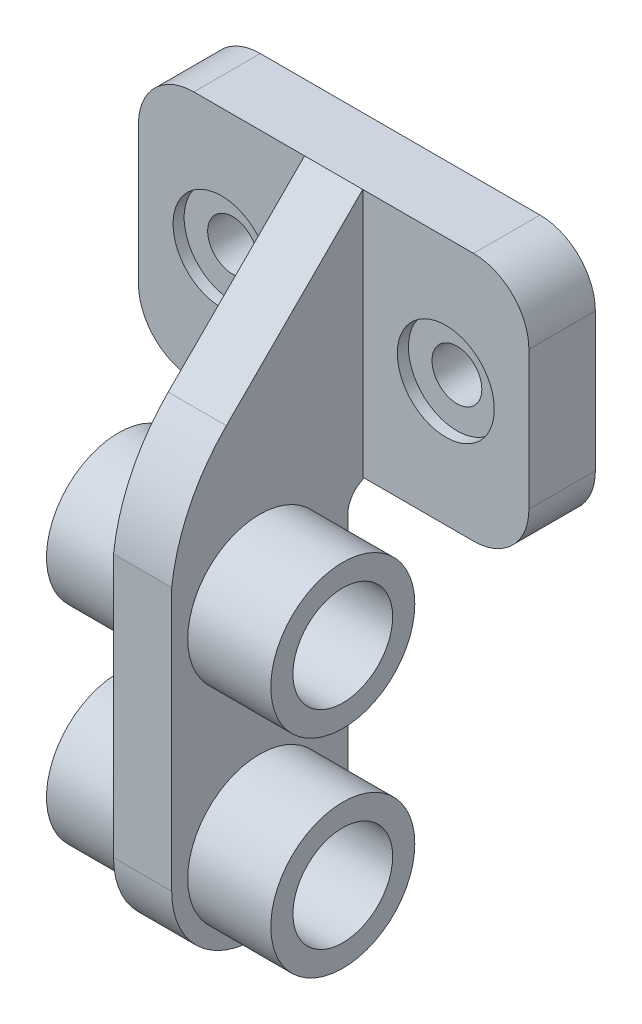
ISO-10303-21;
HEADER;
FILE_DESCRIPTION(('STEP AP214'),'2;1');
FILE_NAME('part.step','',(''),(''),'','','');
FILE_SCHEMA(('AUTOMOTIVE_DESIGN { 1 0 10303 214 1 1 1 1 }'));
ENDSEC;
DATA;
#1=APPLICATION_CONTEXT('core data for automotive mechanical design processes');
#2=APPLICATION_PROTOCOL_DEFINITION('international standard','automotive_design',2000,#1);
#3=PRODUCT_CONTEXT('',#1,'mechanical');
#4=PRODUCT('Part','Part','',(#3));
#5=PRODUCT_RELATED_PRODUCT_CATEGORY('part','',(#4));
#6=PRODUCT_DEFINITION_FORMATION('','',#4);
#7=PRODUCT_DEFINITION_CONTEXT('part definition',#1,'design');
#8=PRODUCT_DEFINITION('design','',#6,#7);
#9=PRODUCT_DEFINITION_SHAPE('','',#8);
#10=(LENGTH_UNIT() NAMED_UNIT(*) SI_UNIT(.MILLI.,.METRE.));
#11=(NAMED_UNIT(*) PLANE_ANGLE_UNIT() SI_UNIT($,.RADIAN.));
#12=(NAMED_UNIT(*) SI_UNIT($,.STERADIAN.) SOLID_ANGLE_UNIT());
#13=UNCERTAINTY_MEASURE_WITH_UNIT(LENGTH_MEASURE(1.E-05),#10,'distance_accuracy_value','');
#14=(GEOMETRIC_REPRESENTATION_CONTEXT(3) GLOBAL_UNCERTAINTY_ASSIGNED_CONTEXT((#13)) GLOBAL_UNIT_ASSIGNED_CONTEXT((#10,
#11,#12)) REPRESENTATION_CONTEXT('',''));
#15=CARTESIAN_POINT('',(0.,0.,0.));
#16=DIRECTION('',(0.,0.,1.));
#17=DIRECTION('',(1.,0.,0.));
#18=AXIS2_PLACEMENT_3D('',#15,#16,#17);
#19=CARTESIAN_POINT('',(-70.5,-45.,24.));
#20=DIRECTION('',(0.,1.,0.));
#21=DIRECTION('',(0.,0.,1.));
#22=AXIS2_PLACEMENT_3D('',#19,#20,#21);
#23=PLANE('',#22);
#24=DIRECTION('',(1.,0.,0.));
#25=VECTOR('',#24,1.);
#26=CARTESIAN_POINT('',(-70.5,-45.,24.));
#27=LINE('',#26,#25);
#28=CARTESIAN_POINT('',(10.5,-45.,24.));
#29=VERTEX_POINT('',#28);
#30=CARTESIAN_POINT('',(50.5,-45.,24.));
#31=VERTEX_POINT('',#30);
#32=EDGE_CURVE('E311',#29,#31,#27,.T.);
#33=ORIENTED_EDGE('',*,*,#32,.F.);
#34=DIRECTION('',(0.,0.,-1.));
#35=VECTOR('',#34,1.);
#36=CARTESIAN_POINT('',(10.5,-45.,93.));
#37=LINE('',#36,#35);
#38=CARTESIAN_POINT('',(10.5,-45.,20.4104553635286));
#39=VERTEX_POINT('',#38);
#40=EDGE_CURVE('E204',#29,#39,#37,.T.);
#41=ORIENTED_EDGE('',*,*,#40,.T.);
#42=DIRECTION('',(1.,0.,0.));
#43=VECTOR('',#42,1.);
#44=CARTESIAN_POINT('',(-10.5,-45.,20.4104553635286));
#45=LINE('',#44,#43);
#46=CARTESIAN_POINT('',(-10.5,-45.,20.4104553635286));
#47=VERTEX_POINT('',#46);
#48=EDGE_CURVE('E201',#39,#47,#45,.F.);
#49=ORIENTED_EDGE('',*,*,#48,.T.);
#50=DIRECTION('',(0.,0.,1.));
#51=VECTOR('',#50,1.);
#52=CARTESIAN_POINT('',(-10.5,-45.,93.));
#53=LINE('',#52,#51);
#54=CARTESIAN_POINT('',(-10.5,-45.,24.));
#55=VERTEX_POINT('',#54);
#56=EDGE_CURVE('E199',#47,#55,#53,.T.);
#57=ORIENTED_EDGE('',*,*,#56,.T.);
#58=CARTESIAN_POINT('',(-50.5,-45.,24.));
#59=VERTEX_POINT('',#58);
#60=EDGE_CURVE('E312',#59,#55,#27,.T.);
#61=ORIENTED_EDGE('',*,*,#60,.F.);
#62=DIRECTION('',(0.,0.,-1.));
#63=VECTOR('',#62,1.);
#64=CARTESIAN_POINT('',(-50.5,-45.,24.));
#65=LINE('',#64,#63);
#66=CARTESIAN_POINT('',(-50.5,-45.,0.));
#67=VERTEX_POINT('',#66);
#68=EDGE_CURVE('E338',#59,#67,#65,.T.);
#69=ORIENTED_EDGE('',*,*,#68,.T.);
#70=DIRECTION('',(1.,0.,0.));
#71=VECTOR('',#70,1.);
#72=CARTESIAN_POINT('',(-70.5,-45.,0.));
#73=LINE('',#72,#71);
#74=CARTESIAN_POINT('',(50.5,-45.,0.));
#75=VERTEX_POINT('',#74);
#76=EDGE_CURVE('E304',#67,#75,#73,.T.);
#77=ORIENTED_EDGE('',*,*,#76,.T.);
#78=DIRECTION('',(0.,0.,-1.));
#79=VECTOR('',#78,1.);
#80=CARTESIAN_POINT('',(50.5,-45.,24.));
#81=LINE('',#80,#79);
#82=EDGE_CURVE('E341',#75,#31,#81,.F.);
#83=ORIENTED_EDGE('',*,*,#82,.T.);
#84=EDGE_LOOP('',(#33,#41,#49,#57,#61,#69,#77,#83));
#85=FACE_BOUND('',#84,.T.);
#86=ADVANCED_FACE('F38',(#85),#23,.F.);
#87=CARTESIAN_POINT('',(0.,0.,24.));
#88=DIRECTION('',(0.,0.,1.));
#89=DIRECTION('',(1.,0.,0.));
#90=AXIS2_PLACEMENT_3D('',#87,#88,#89);
#91=PLANE('',#90);
#92=DIRECTION('',(0.,1.,0.));
#93=VECTOR('',#92,1.);
#94=CARTESIAN_POINT('',(10.5,45.,24.));
#95=LINE('',#94,#93);
#96=CARTESIAN_POINT('',(10.5,45.,24.));
#97=VERTEX_POINT('',#96);
#98=EDGE_CURVE('E282',#29,#97,#95,.T.);
#99=ORIENTED_EDGE('',*,*,#98,.F.);
#100=ORIENTED_EDGE('',*,*,#32,.T.);
#101=CARTESIAN_POINT('',(50.5,-25.,24.));
#102=DIRECTION('',(0.,0.,1.));
#103=DIRECTION('',(1.,0.,0.));
#104=AXIS2_PLACEMENT_3D('',#101,#102,#103);
#105=CIRCLE('',#104,20.);
#106=CARTESIAN_POINT('',(70.5,-25.,24.));
#107=VERTEX_POINT('',#106);
#108=EDGE_CURVE('E350',#31,#107,#105,.T.);
#109=ORIENTED_EDGE('',*,*,#108,.T.);
#110=DIRECTION('',(0.,1.,0.));
#111=VECTOR('',#110,1.);
#112=CARTESIAN_POINT('',(70.5,45.,24.));
#113=LINE('',#112,#111);
#114=CARTESIAN_POINT('',(70.5,25.,24.));
#115=VERTEX_POINT('',#114);
#116=EDGE_CURVE('E300',#107,#115,#113,.T.);
#117=ORIENTED_EDGE('',*,*,#116,.T.);
#118=CARTESIAN_POINT('',(50.5,25.,24.));
#119=DIRECTION('',(0.,0.,1.));
#120=DIRECTION('',(1.,0.,0.));
#121=AXIS2_PLACEMENT_3D('',#118,#119,#120);
#122=CIRCLE('',#121,20.);
#123=CARTESIAN_POINT('',(50.5,45.,24.));
#124=VERTEX_POINT('',#123);
#125=EDGE_CURVE('E344',#115,#124,#122,.T.);
#126=ORIENTED_EDGE('',*,*,#125,.T.);
#127=DIRECTION('',(-1.,0.,0.));
#128=VECTOR('',#127,1.);
#129=CARTESIAN_POINT('',(-70.5,45.,24.));
#130=LINE('',#129,#128);
#131=EDGE_CURVE('E305',#124,#97,#130,.T.);
#132=ORIENTED_EDGE('',*,*,#131,.T.);
#133=EDGE_LOOP('',(#99,#100,#109,#117,#126,#132));
#134=FACE_BOUND('',#133,.T.);
#135=CARTESIAN_POINT('',(40.5,0.,24.));
#136=DIRECTION('',(0.,0.,1.));
#137=DIRECTION('',(-1.,0.,0.));
#138=AXIS2_PLACEMENT_3D('',#135,#136,#137);
#139=CIRCLE('',#138,17.5);
#140=CARTESIAN_POINT('',(23.,0.,24.));
#141=VERTEX_POINT('',#140);
#142=EDGE_CURVE('E180',#141,#141,#139,.T.);
#143=ORIENTED_EDGE('',*,*,#142,.F.);
#144=EDGE_LOOP('',(#143));
#145=FACE_BOUND('',#144,.T.);
#146=ADVANCED_FACE('F374',(#134,#145),#91,.T.);
#147=CARTESIAN_POINT('',(70.5,45.,24.));
#148=DIRECTION('',(-1.,0.,0.));
#149=DIRECTION('',(0.,-1.,0.));
#150=AXIS2_PLACEMENT_3D('',#147,#148,#149);
#151=PLANE('',#150);
#152=ORIENTED_EDGE('',*,*,#116,.F.);
#153=DIRECTION('',(0.,0.,-1.));
#154=VECTOR('',#153,1.);
#155=CARTESIAN_POINT('',(70.5,-25.,24.));
#156=LINE('',#155,#154);
#157=CARTESIAN_POINT('',(70.5,-25.,0.));
#158=VERTEX_POINT('',#157);
#159=EDGE_CURVE('E327',#107,#158,#156,.T.);
#160=ORIENTED_EDGE('',*,*,#159,.T.);
#161=DIRECTION('',(0.,1.,0.));
#162=VECTOR('',#161,1.);
#163=CARTESIAN_POINT('',(70.5,45.,0.));
#164=LINE('',#163,#162);
#165=CARTESIAN_POINT('',(70.5,25.,0.));
#166=VERTEX_POINT('',#165);
#167=EDGE_CURVE('E291',#158,#166,#164,.T.);
#168=ORIENTED_EDGE('',*,*,#167,.T.);
#169=DIRECTION('',(0.,0.,-1.));
#170=VECTOR('',#169,1.);
#171=CARTESIAN_POINT('',(70.5,25.,24.));
#172=LINE('',#171,#170);
#173=EDGE_CURVE('E315',#166,#115,#172,.F.);
#174=ORIENTED_EDGE('',*,*,#173,.T.);
#175=EDGE_LOOP('',(#152,#160,#168,#174));
#176=FACE_BOUND('',#175,.T.);
#177=ADVANCED_FACE('F412',(#176),#151,.F.);
#178=CARTESIAN_POINT('',(-70.5,45.,24.));
#179=DIRECTION('',(0.,-1.,0.));
#180=DIRECTION('',(0.,0.,-1.));
#181=AXIS2_PLACEMENT_3D('',#178,#179,#180);
#182=PLANE('',#181);
#183=CARTESIAN_POINT('',(-10.5,45.,24.));
#184=VERTEX_POINT('',#183);
#185=CARTESIAN_POINT('',(-50.5,45.,24.));
#186=VERTEX_POINT('',#185);
#187=EDGE_CURVE('E303',#184,#186,#130,.T.);
#188=ORIENTED_EDGE('',*,*,#187,.F.);
#189=DIRECTION('',(1.,0.,0.));
#190=VECTOR('',#189,1.);
#191=CARTESIAN_POINT('',(10.5,45.,24.));
#192=LINE('',#191,#190);
#193=EDGE_CURVE('E191',#184,#97,#192,.T.);
#194=ORIENTED_EDGE('',*,*,#193,.T.);
#195=ORIENTED_EDGE('',*,*,#131,.F.);
#196=DIRECTION('',(0.,0.,-1.));
#197=VECTOR('',#196,1.);
#198=CARTESIAN_POINT('',(50.5,45.,24.));
#199=LINE('',#198,#197);
#200=CARTESIAN_POINT('',(50.5,45.,0.));
#201=VERTEX_POINT('',#200);
#202=EDGE_CURVE('E357',#124,#201,#199,.T.);
#203=ORIENTED_EDGE('',*,*,#202,.T.);
#204=DIRECTION('',(-1.,0.,0.));
#205=VECTOR('',#204,1.);
#206=CARTESIAN_POINT('',(-70.5,45.,0.));
#207=LINE('',#206,#205);
#208=CARTESIAN_POINT('',(-50.5,45.,0.));
#209=VERTEX_POINT('',#208);
#210=EDGE_CURVE('E318',#201,#209,#207,.T.);
#211=ORIENTED_EDGE('',*,*,#210,.T.);
#212=DIRECTION('',(0.,0.,-1.));
#213=VECTOR('',#212,1.);
#214=CARTESIAN_POINT('',(-50.5,45.,24.));
#215=LINE('',#214,#213);
#216=EDGE_CURVE('E360',#209,#186,#215,.F.);
#217=ORIENTED_EDGE('',*,*,#216,.T.);
#218=EDGE_LOOP('',(#188,#194,#195,#203,#211,#217));
#219=FACE_BOUND('',#218,.T.);
#220=ADVANCED_FACE('F368',(#219),#182,.F.);
#221=CARTESIAN_POINT('',(-70.5,45.,24.));
#222=DIRECTION('',(1.,0.,0.));
#223=DIRECTION('',(0.,0.,-1.));
#224=AXIS2_PLACEMENT_3D('',#221,#222,#223);
#225=PLANE('',#224);
#226=DIRECTION('',(0.,-1.,0.));
#227=VECTOR('',#226,1.);
#228=CARTESIAN_POINT('',(-70.5,45.,0.));
#229=LINE('',#228,#227);
#230=CARTESIAN_POINT('',(-70.5,25.,0.));
#231=VERTEX_POINT('',#230);
#232=CARTESIAN_POINT('',(-70.5,-25.,0.));
#233=VERTEX_POINT('',#232);
#234=EDGE_CURVE('E321',#231,#233,#229,.T.);
#235=ORIENTED_EDGE('',*,*,#234,.T.);
#236=DIRECTION('',(0.,0.,-1.));
#237=VECTOR('',#236,1.);
#238=CARTESIAN_POINT('',(-70.5,-25.,24.));
#239=LINE('',#238,#237);
#240=CARTESIAN_POINT('',(-70.5,-25.,24.));
#241=VERTEX_POINT('',#240);
#242=EDGE_CURVE('E355',#233,#241,#239,.F.);
#243=ORIENTED_EDGE('',*,*,#242,.T.);
#244=DIRECTION('',(0.,-1.,0.));
#245=VECTOR('',#244,1.);
#246=CARTESIAN_POINT('',(-70.5,45.,24.));
#247=LINE('',#246,#245);
#248=CARTESIAN_POINT('',(-70.5,25.,24.));
#249=VERTEX_POINT('',#248);
#250=EDGE_CURVE('E308',#249,#241,#247,.T.);
#251=ORIENTED_EDGE('',*,*,#250,.F.);
#252=DIRECTION('',(0.,0.,-1.));
#253=VECTOR('',#252,1.);
#254=CARTESIAN_POINT('',(-70.5,25.,24.));
#255=LINE('',#254,#253);
#256=EDGE_CURVE('E352',#249,#231,#255,.T.);
#257=ORIENTED_EDGE('',*,*,#256,.T.);
#258=EDGE_LOOP('',(#235,#243,#251,#257));
#259=FACE_BOUND('',#258,.T.);
#260=ADVANCED_FACE('F399',(#259),#225,.F.);
#261=DIRECTION('',(0.,-1.,0.));
#262=VECTOR('',#261,1.);
#263=CARTESIAN_POINT('',(-10.5,45.,24.));
#264=LINE('',#263,#262);
#265=EDGE_CURVE('E181',#184,#55,#264,.T.);
#266=ORIENTED_EDGE('',*,*,#265,.F.);
#267=ORIENTED_EDGE('',*,*,#187,.T.);
#268=CARTESIAN_POINT('',(-50.5,25.,24.));
#269=DIRECTION('',(0.,0.,1.));
#270=DIRECTION('',(1.,0.,0.));
#271=AXIS2_PLACEMENT_3D('',#268,#269,#270);
#272=CIRCLE('',#271,20.);
#273=EDGE_CURVE('E346',#186,#249,#272,.T.);
#274=ORIENTED_EDGE('',*,*,#273,.T.);
#275=ORIENTED_EDGE('',*,*,#250,.T.);
#276=CARTESIAN_POINT('',(-50.5,-25.,24.));
#277=DIRECTION('',(0.,0.,1.));
#278=DIRECTION('',(1.,0.,0.));
#279=AXIS2_PLACEMENT_3D('',#276,#277,#278);
#280=CIRCLE('',#279,20.);
#281=EDGE_CURVE('E348',#241,#59,#280,.T.);
#282=ORIENTED_EDGE('',*,*,#281,.T.);
#283=ORIENTED_EDGE('',*,*,#60,.T.);
#284=EDGE_LOOP('',(#266,#267,#274,#275,#282,#283));
#285=FACE_BOUND('',#284,.T.);
#286=CARTESIAN_POINT('',(-40.5,0.,24.));
#287=DIRECTION('',(0.,0.,1.));
#288=DIRECTION('',(1.,0.,0.));
#289=AXIS2_PLACEMENT_3D('',#286,#287,#288);
#290=CIRCLE('',#289,17.5);
#291=CARTESIAN_POINT('',(-23.,0.,24.));
#292=VERTEX_POINT('',#291);
#293=EDGE_CURVE('E292',#292,#292,#290,.T.);
#294=ORIENTED_EDGE('',*,*,#293,.F.);
#295=EDGE_LOOP('',(#294));
#296=FACE_BOUND('',#295,.T.);
#297=ADVANCED_FACE('F384',(#285,#296),#91,.T.);
#298=CARTESIAN_POINT('',(0.,0.,0.));
#299=DIRECTION('',(0.,0.,1.));
#300=DIRECTION('',(1.,0.,0.));
#301=AXIS2_PLACEMENT_3D('',#298,#299,#300);
#302=PLANE('',#301);
#303=CARTESIAN_POINT('',(-40.5,0.,0.));
#304=DIRECTION('',(0.,0.,1.));
#305=DIRECTION('',(1.,0.,0.));
#306=AXIS2_PLACEMENT_3D('',#303,#304,#305);
#307=CIRCLE('',#306,9.);
#308=CARTESIAN_POINT('',(-31.5,0.,0.));
#309=VERTEX_POINT('',#308);
#310=EDGE_CURVE('E42',#309,#309,#307,.T.);
#311=ORIENTED_EDGE('',*,*,#310,.T.);
#312=EDGE_LOOP('',(#311));
#313=FACE_BOUND('',#312,.T.);
#314=CARTESIAN_POINT('',(40.5,0.,0.));
#315=DIRECTION('',(0.,0.,1.));
#316=DIRECTION('',(1.,0.,0.));
#317=AXIS2_PLACEMENT_3D('',#314,#315,#316);
#318=CIRCLE('',#317,9.);
#319=CARTESIAN_POINT('',(49.5,0.,0.));
#320=VERTEX_POINT('',#319);
#321=EDGE_CURVE('E234',#320,#320,#318,.T.);
#322=ORIENTED_EDGE('',*,*,#321,.T.);
#323=EDGE_LOOP('',(#322));
#324=FACE_BOUND('',#323,.T.);
#325=ORIENTED_EDGE('',*,*,#167,.F.);
#326=CARTESIAN_POINT('',(50.5,-25.,0.));
#327=DIRECTION('',(0.,0.,1.));
#328=DIRECTION('',(1.,0.,0.));
#329=AXIS2_PLACEMENT_3D('',#326,#327,#328);
#330=CIRCLE('',#329,20.);
#331=EDGE_CURVE('E336',#158,#75,#330,.F.);
#332=ORIENTED_EDGE('',*,*,#331,.T.);
#333=ORIENTED_EDGE('',*,*,#76,.F.);
#334=CARTESIAN_POINT('',(-50.5,-25.,0.));
#335=DIRECTION('',(0.,0.,1.));
#336=DIRECTION('',(1.,0.,0.));
#337=AXIS2_PLACEMENT_3D('',#334,#335,#336);
#338=CIRCLE('',#337,20.);
#339=EDGE_CURVE('E334',#67,#233,#338,.F.);
#340=ORIENTED_EDGE('',*,*,#339,.T.);
#341=ORIENTED_EDGE('',*,*,#234,.F.);
#342=CARTESIAN_POINT('',(-50.5,25.,0.));
#343=DIRECTION('',(0.,0.,1.));
#344=DIRECTION('',(1.,0.,0.));
#345=AXIS2_PLACEMENT_3D('',#342,#343,#344);
#346=CIRCLE('',#345,20.);
#347=EDGE_CURVE('E332',#231,#209,#346,.F.);
#348=ORIENTED_EDGE('',*,*,#347,.T.);
#349=ORIENTED_EDGE('',*,*,#210,.F.);
#350=CARTESIAN_POINT('',(50.5,25.,0.));
#351=DIRECTION('',(0.,0.,1.));
#352=DIRECTION('',(1.,0.,0.));
#353=AXIS2_PLACEMENT_3D('',#350,#351,#352);
#354=CIRCLE('',#353,20.);
#355=EDGE_CURVE('E330',#201,#166,#354,.F.);
#356=ORIENTED_EDGE('',*,*,#355,.T.);
#357=EDGE_LOOP('',(#325,#332,#333,#340,#341,#348,#349,#356));
#358=FACE_BOUND('',#357,.T.);
#359=ADVANCED_FACE('F397',(#313,#324,#358),#302,.F.);
#360=CARTESIAN_POINT('',(50.5,-25.,24.));
#361=DIRECTION('',(0.,0.,-1.));
#362=DIRECTION('',(-1.,0.,0.));
#363=AXIS2_PLACEMENT_3D('',#360,#361,#362);
#364=CYLINDRICAL_SURFACE('',#363,20.);
#365=ORIENTED_EDGE('',*,*,#108,.F.);
#366=ORIENTED_EDGE('',*,*,#82,.F.);
#367=ORIENTED_EDGE('',*,*,#331,.F.);
#368=ORIENTED_EDGE('',*,*,#159,.F.);
#369=EDGE_LOOP('',(#365,#366,#367,#368));
#370=FACE_BOUND('',#369,.T.);
#371=ADVANCED_FACE('F416',(#370),#364,.T.);
#372=CARTESIAN_POINT('',(-50.5,-25.,24.));
#373=DIRECTION('',(0.,0.,-1.));
#374=DIRECTION('',(-1.,0.,0.));
#375=AXIS2_PLACEMENT_3D('',#372,#373,#374);
#376=CYLINDRICAL_SURFACE('',#375,20.);
#377=ORIENTED_EDGE('',*,*,#281,.F.);
#378=ORIENTED_EDGE('',*,*,#242,.F.);
#379=ORIENTED_EDGE('',*,*,#339,.F.);
#380=ORIENTED_EDGE('',*,*,#68,.F.);
#381=EDGE_LOOP('',(#377,#378,#379,#380));
#382=FACE_BOUND('',#381,.T.);
#383=ADVANCED_FACE('F392',(#382),#376,.T.);
#384=CARTESIAN_POINT('',(-50.5,25.,24.));
#385=DIRECTION('',(0.,0.,-1.));
#386=DIRECTION('',(-1.,0.,0.));
#387=AXIS2_PLACEMENT_3D('',#384,#385,#386);
#388=CYLINDRICAL_SURFACE('',#387,20.);
#389=ORIENTED_EDGE('',*,*,#273,.F.);
#390=ORIENTED_EDGE('',*,*,#216,.F.);
#391=ORIENTED_EDGE('',*,*,#347,.F.);
#392=ORIENTED_EDGE('',*,*,#256,.F.);
#393=EDGE_LOOP('',(#389,#390,#391,#392));
#394=FACE_BOUND('',#393,.T.);
#395=ADVANCED_FACE('F404',(#394),#388,.T.);
#396=CARTESIAN_POINT('',(50.5,25.,24.));
#397=DIRECTION('',(0.,0.,-1.));
#398=DIRECTION('',(-1.,0.,0.));
#399=AXIS2_PLACEMENT_3D('',#396,#397,#398);
#400=CYLINDRICAL_SURFACE('',#399,20.);
#401=ORIENTED_EDGE('',*,*,#125,.F.);
#402=ORIENTED_EDGE('',*,*,#173,.F.);
#403=ORIENTED_EDGE('',*,*,#355,.F.);
#404=ORIENTED_EDGE('',*,*,#202,.F.);
#405=EDGE_LOOP('',(#401,#402,#403,#404));
#406=FACE_BOUND('',#405,.T.);
#407=ADVANCED_FACE('F408',(#406),#400,.T.);
#408=CARTESIAN_POINT('',(40.5,0.,20.));
#409=DIRECTION('',(0.,0.,1.));
#410=DIRECTION('',(1.,0.,0.));
#411=AXIS2_PLACEMENT_3D('',#408,#409,#410);
#412=CYLINDRICAL_SURFACE('',#411,17.5);
#413=CARTESIAN_POINT('',(40.5,0.,20.));
#414=DIRECTION('',(0.,0.,1.));
#415=DIRECTION('',(-1.,0.,0.));
#416=AXIS2_PLACEMENT_3D('',#413,#414,#415);
#417=CIRCLE('',#416,17.5);
#418=CARTESIAN_POINT('',(23.,0.,20.));
#419=VERTEX_POINT('',#418);
#420=EDGE_CURVE('E295',#419,#419,#417,.T.);
#421=ORIENTED_EDGE('',*,*,#420,.F.);
#422=EDGE_LOOP('',(#421));
#423=FACE_BOUND('',#422,.T.);
#424=ORIENTED_EDGE('',*,*,#142,.T.);
#425=EDGE_LOOP('',(#424));
#426=FACE_BOUND('',#425,.T.);
#427=ADVANCED_FACE('F464',(#423,#426),#412,.F.);
#428=CARTESIAN_POINT('',(40.5,0.,20.));
#429=DIRECTION('',(0.,0.,-1.));
#430=DIRECTION('',(-1.,0.,0.));
#431=AXIS2_PLACEMENT_3D('',#428,#429,#430);
#432=PLANE('',#431);
#433=CARTESIAN_POINT('',(40.5,0.,20.));
#434=DIRECTION('',(0.,0.,1.));
#435=DIRECTION('',(1.,0.,0.));
#436=AXIS2_PLACEMENT_3D('',#433,#434,#435);
#437=CIRCLE('',#436,9.);
#438=CARTESIAN_POINT('',(49.5,0.,20.));
#439=VERTEX_POINT('',#438);
#440=EDGE_CURVE('E237',#439,#439,#437,.T.);
#441=ORIENTED_EDGE('',*,*,#440,.F.);
#442=EDGE_LOOP('',(#441));
#443=FACE_BOUND('',#442,.T.);
#444=ORIENTED_EDGE('',*,*,#420,.T.);
#445=EDGE_LOOP('',(#444));
#446=FACE_BOUND('',#445,.T.);
#447=ADVANCED_FACE('F500',(#443,#446),#432,.F.);
#448=CARTESIAN_POINT('',(-40.5,0.,20.));
#449=DIRECTION('',(0.,0.,1.));
#450=DIRECTION('',(1.,0.,0.));
#451=AXIS2_PLACEMENT_3D('',#448,#449,#450);
#452=CYLINDRICAL_SURFACE('',#451,17.5);
#453=CARTESIAN_POINT('',(-40.5,0.,20.));
#454=DIRECTION('',(0.,0.,1.));
#455=DIRECTION('',(1.,0.,0.));
#456=AXIS2_PLACEMENT_3D('',#453,#454,#455);
#457=CIRCLE('',#456,17.5);
#458=CARTESIAN_POINT('',(-23.,0.,20.));
#459=VERTEX_POINT('',#458);
#460=EDGE_CURVE('E288',#459,#459,#457,.T.);
#461=ORIENTED_EDGE('',*,*,#460,.F.);
#462=EDGE_LOOP('',(#461));
#463=FACE_BOUND('',#462,.T.);
#464=ORIENTED_EDGE('',*,*,#293,.T.);
#465=EDGE_LOOP('',(#464));
#466=FACE_BOUND('',#465,.T.);
#467=ADVANCED_FACE('F496',(#463,#466),#452,.F.);
#468=CARTESIAN_POINT('',(-40.5,0.,20.));
#469=DIRECTION('',(0.,0.,1.));
#470=DIRECTION('',(1.,0.,0.));
#471=AXIS2_PLACEMENT_3D('',#468,#469,#470);
#472=PLANE('',#471);
#473=CARTESIAN_POINT('',(-40.5,0.,20.));
#474=DIRECTION('',(0.,0.,1.));
#475=DIRECTION('',(1.,0.,0.));
#476=AXIS2_PLACEMENT_3D('',#473,#474,#475);
#477=CIRCLE('',#476,9.);
#478=CARTESIAN_POINT('',(-31.5,0.,20.));
#479=VERTEX_POINT('',#478);
#480=EDGE_CURVE('E248',#479,#479,#477,.T.);
#481=ORIENTED_EDGE('',*,*,#480,.F.);
#482=EDGE_LOOP('',(#481));
#483=FACE_BOUND('',#482,.T.);
#484=ORIENTED_EDGE('',*,*,#460,.T.);
#485=EDGE_LOOP('',(#484));
#486=FACE_BOUND('',#485,.T.);
#487=ADVANCED_FACE('F492',(#483,#486),#472,.T.);
#488=CARTESIAN_POINT('',(10.5,45.,93.));
#489=DIRECTION('',(-1.,0.,0.));
#490=DIRECTION('',(0.,0.,1.));
#491=AXIS2_PLACEMENT_3D('',#488,#489,#490);
#492=PLANE('',#491);
#493=CARTESIAN_POINT('',(10.5,-139.,61.2052276817643));
#494=DIRECTION('',(-1.,0.,0.));
#495=DIRECTION('',(0.,0.,1.));
#496=AXIS2_PLACEMENT_3D('',#493,#494,#495);
#497=CIRCLE('',#496,26.);
#498=CARTESIAN_POINT('',(10.5,-139.,87.2052276817643));
#499=VERTEX_POINT('',#498);
#500=EDGE_CURVE('E232',#499,#499,#497,.T.);
#501=ORIENTED_EDGE('',*,*,#500,.T.);
#502=EDGE_LOOP('',(#501));
#503=FACE_BOUND('',#502,.T.);
#504=CARTESIAN_POINT('',(10.5,-64.,61.2052276817643));
#505=DIRECTION('',(-1.,0.,0.));
#506=DIRECTION('',(0.,0.,1.));
#507=AXIS2_PLACEMENT_3D('',#504,#505,#506);
#508=CIRCLE('',#507,26.);
#509=CARTESIAN_POINT('',(10.5,-64.,87.2052276817643));
#510=VERTEX_POINT('',#509);
#511=EDGE_CURVE('E228',#510,#510,#508,.T.);
#512=ORIENTED_EDGE('',*,*,#511,.T.);
#513=EDGE_LOOP('',(#512));
#514=FACE_BOUND('',#513,.T.);
#515=DIRECTION('',(0.,0.,1.));
#516=VECTOR('',#515,1.);
#517=CARTESIAN_POINT('',(10.5,-170.,93.));
#518=LINE('',#517,#516);
#519=CARTESIAN_POINT('',(10.5,-170.,59.4104553635286));
#520=VERTEX_POINT('',#519);
#521=CARTESIAN_POINT('',(10.5,-170.,63.));
#522=VERTEX_POINT('',#521);
#523=EDGE_CURVE('E273',#520,#522,#518,.T.);
#524=ORIENTED_EDGE('',*,*,#523,.F.);
#525=CARTESIAN_POINT('',(10.5,-140.,59.4104553635286));
#526=DIRECTION('',(-1.,0.,0.));
#527=DIRECTION('',(0.,0.,1.));
#528=AXIS2_PLACEMENT_3D('',#525,#526,#527);
#529=CIRCLE('',#528,30.);
#530=CARTESIAN_POINT('',(10.5,-140.,29.4104553635286));
#531=VERTEX_POINT('',#530);
#532=EDGE_CURVE('E220',#520,#531,#529,.F.);
#533=ORIENTED_EDGE('',*,*,#532,.T.);
#534=DIRECTION('',(0.,1.,0.));
#535=VECTOR('',#534,1.);
#536=CARTESIAN_POINT('',(10.5,-170.,29.4104553635286));
#537=LINE('',#536,#535);
#538=CARTESIAN_POINT('',(10.5,-54.,29.4104553635286));
#539=VERTEX_POINT('',#538);
#540=EDGE_CURVE('E279',#531,#539,#537,.T.);
#541=ORIENTED_EDGE('',*,*,#540,.T.);
#542=CARTESIAN_POINT('',(10.5,-54.,20.4104553635286));
#543=DIRECTION('',(-1.,0.,0.));
#544=DIRECTION('',(0.,0.,1.));
#545=AXIS2_PLACEMENT_3D('',#542,#543,#544);
#546=CIRCLE('',#545,9.);
#547=EDGE_CURVE('E207',#539,#39,#546,.T.);
#548=ORIENTED_EDGE('',*,*,#547,.T.);
#549=ORIENTED_EDGE('',*,*,#40,.F.);
#550=ORIENTED_EDGE('',*,*,#98,.T.);
#551=DIRECTION('',(0.,-0.707106781186547,0.707106781186548));
#552=VECTOR('',#551,1.);
#553=CARTESIAN_POINT('',(10.5,-24.,93.));
#554=LINE('',#553,#552);
#555=CARTESIAN_POINT('',(10.5,-4.26181675531233,73.2618167553124));
#556=VERTEX_POINT('',#555);
#557=EDGE_CURVE('E186',#97,#556,#554,.T.);
#558=ORIENTED_EDGE('',*,*,#557,.T.);
#559=CARTESIAN_POINT('',(10.5,-53.0521846571841,24.4714488534406));
#560=DIRECTION('',(-1.,0.,0.));
#561=DIRECTION('',(0.,0.,1.));
#562=AXIS2_PLACEMENT_3D('',#559,#560,#561);
#563=CIRCLE('',#562,69.);
#564=CARTESIAN_POINT('',(10.5,-45.,93.));
#565=VERTEX_POINT('',#564);
#566=EDGE_CURVE('E188',#556,#565,#563,.F.);
#567=ORIENTED_EDGE('',*,*,#566,.T.);
#568=DIRECTION('',(0.,1.,0.));
#569=VECTOR('',#568,1.);
#570=CARTESIAN_POINT('',(10.5,-170.,93.));
#571=LINE('',#570,#569);
#572=CARTESIAN_POINT('',(10.5,-140.,93.));
#573=VERTEX_POINT('',#572);
#574=EDGE_CURVE('E170',#573,#565,#571,.T.);
#575=ORIENTED_EDGE('',*,*,#574,.F.);
#576=CARTESIAN_POINT('',(10.5,-140.,63.));
#577=DIRECTION('',(-1.,0.,0.));
#578=DIRECTION('',(0.,0.,1.));
#579=AXIS2_PLACEMENT_3D('',#576,#577,#578);
#580=CIRCLE('',#579,30.);
#581=EDGE_CURVE('E218',#573,#522,#580,.F.);
#582=ORIENTED_EDGE('',*,*,#581,.T.);
#583=EDGE_LOOP('',(#524,#533,#541,#548,#549,#550,#558,#567,#575,#582));
#584=FACE_BOUND('',#583,.T.);
#585=ADVANCED_FACE('F379',(#503,#514,#584),#492,.F.);
#586=CARTESIAN_POINT('',(-10.5,45.,93.));
#587=DIRECTION('',(1.,0.,0.));
#588=DIRECTION('',(0.,0.,-1.));
#589=AXIS2_PLACEMENT_3D('',#586,#587,#588);
#590=PLANE('',#589);
#591=CARTESIAN_POINT('',(-10.5,-139.,61.2052276817643));
#592=DIRECTION('',(1.,0.,0.));
#593=DIRECTION('',(0.,0.,-1.));
#594=AXIS2_PLACEMENT_3D('',#591,#592,#593);
#595=CIRCLE('',#594,26.);
#596=CARTESIAN_POINT('',(-10.5,-139.,35.2052276817643));
#597=VERTEX_POINT('',#596);
#598=EDGE_CURVE('E230',#597,#597,#595,.T.);
#599=ORIENTED_EDGE('',*,*,#598,.T.);
#600=EDGE_LOOP('',(#599));
#601=FACE_BOUND('',#600,.T.);
#602=CARTESIAN_POINT('',(-10.5,-64.,61.2052276817643));
#603=DIRECTION('',(1.,0.,0.));
#604=DIRECTION('',(0.,0.,-1.));
#605=AXIS2_PLACEMENT_3D('',#602,#603,#604);
#606=CIRCLE('',#605,26.);
#607=CARTESIAN_POINT('',(-10.5,-64.,35.2052276817643));
#608=VERTEX_POINT('',#607);
#609=EDGE_CURVE('E225',#608,#608,#606,.T.);
#610=ORIENTED_EDGE('',*,*,#609,.T.);
#611=EDGE_LOOP('',(#610));
#612=FACE_BOUND('',#611,.T.);
#613=DIRECTION('',(0.,1.,0.));
#614=VECTOR('',#613,1.);
#615=CARTESIAN_POINT('',(-10.5,-170.,29.4104553635286));
#616=LINE('',#615,#614);
#617=CARTESIAN_POINT('',(-10.5,-140.,29.4104553635286));
#618=VERTEX_POINT('',#617);
#619=CARTESIAN_POINT('',(-10.5,-54.,29.4104553635286));
#620=VERTEX_POINT('',#619);
#621=EDGE_CURVE('E171',#618,#620,#616,.T.);
#622=ORIENTED_EDGE('',*,*,#621,.F.);
#623=CARTESIAN_POINT('',(-10.5,-140.,59.4104553635286));
#624=DIRECTION('',(1.,0.,0.));
#625=DIRECTION('',(0.,0.,-1.));
#626=AXIS2_PLACEMENT_3D('',#623,#624,#625);
#627=CIRCLE('',#626,30.);
#628=CARTESIAN_POINT('',(-10.5,-170.,59.4104553635286));
#629=VERTEX_POINT('',#628);
#630=EDGE_CURVE('E47',#618,#629,#627,.F.);
#631=ORIENTED_EDGE('',*,*,#630,.T.);
#632=DIRECTION('',(0.,0.,-1.));
#633=VECTOR('',#632,1.);
#634=CARTESIAN_POINT('',(-10.5,-170.,93.));
#635=LINE('',#634,#633);
#636=CARTESIAN_POINT('',(-10.5,-170.,63.));
#637=VERTEX_POINT('',#636);
#638=EDGE_CURVE('E276',#637,#629,#635,.T.);
#639=ORIENTED_EDGE('',*,*,#638,.F.);
#640=CARTESIAN_POINT('',(-10.5,-140.,63.));
#641=DIRECTION('',(1.,0.,0.));
#642=DIRECTION('',(0.,0.,-1.));
#643=AXIS2_PLACEMENT_3D('',#640,#641,#642);
#644=CIRCLE('',#643,30.);
#645=CARTESIAN_POINT('',(-10.5,-140.,93.));
#646=VERTEX_POINT('',#645);
#647=EDGE_CURVE('E55',#637,#646,#644,.F.);
#648=ORIENTED_EDGE('',*,*,#647,.T.);
#649=DIRECTION('',(0.,1.,0.));
#650=VECTOR('',#649,1.);
#651=CARTESIAN_POINT('',(-10.5,-170.,93.));
#652=LINE('',#651,#650);
#653=CARTESIAN_POINT('',(-10.5,-45.,93.));
#654=VERTEX_POINT('',#653);
#655=EDGE_CURVE('E162',#646,#654,#652,.T.);
#656=ORIENTED_EDGE('',*,*,#655,.T.);
#657=CARTESIAN_POINT('',(-10.5,-53.0521846571841,24.4714488534406));
#658=DIRECTION('',(1.,0.,0.));
#659=DIRECTION('',(0.,0.,-1.));
#660=AXIS2_PLACEMENT_3D('',#657,#658,#659);
#661=CIRCLE('',#660,69.);
#662=CARTESIAN_POINT('',(-10.5,-4.26181675531233,73.2618167553124));
#663=VERTEX_POINT('',#662);
#664=EDGE_CURVE('E166',#654,#663,#661,.F.);
#665=ORIENTED_EDGE('',*,*,#664,.T.);
#666=DIRECTION('',(0.,0.707106781186547,-0.707106781186548));
#667=VECTOR('',#666,1.);
#668=CARTESIAN_POINT('',(-10.5,-24.,93.));
#669=LINE('',#668,#667);
#670=EDGE_CURVE('E363',#663,#184,#669,.T.);
#671=ORIENTED_EDGE('',*,*,#670,.T.);
#672=ORIENTED_EDGE('',*,*,#265,.T.);
#673=ORIENTED_EDGE('',*,*,#56,.F.);
#674=CARTESIAN_POINT('',(-10.5,-54.,20.4104553635286));
#675=DIRECTION('',(1.,0.,0.));
#676=DIRECTION('',(0.,0.,-1.));
#677=AXIS2_PLACEMENT_3D('',#674,#675,#676);
#678=CIRCLE('',#677,9.);
#679=EDGE_CURVE('E209',#47,#620,#678,.T.);
#680=ORIENTED_EDGE('',*,*,#679,.T.);
#681=EDGE_LOOP('',(#622,#631,#639,#648,#656,#665,#671,#672,#673,#680));
#682=FACE_BOUND('',#681,.T.);
#683=ADVANCED_FACE('F164',(#601,#612,#682),#590,.F.);
#684=CARTESIAN_POINT('',(0.,-24.,93.));
#685=DIRECTION('',(0.,0.707106781186548,0.707106781186547));
#686=DIRECTION('',(1.,0.,0.));
#687=AXIS2_PLACEMENT_3D('',#684,#685,#686);
#688=PLANE('',#687);
#689=ORIENTED_EDGE('',*,*,#670,.F.);
#690=DIRECTION('',(1.,0.,0.));
#691=VECTOR('',#690,1.);
#692=CARTESIAN_POINT('',(10.5,-4.26181675531233,73.2618167553124));
#693=LINE('',#692,#691);
#694=EDGE_CURVE('E185',#663,#556,#693,.T.);
#695=ORIENTED_EDGE('',*,*,#694,.T.);
#696=ORIENTED_EDGE('',*,*,#557,.F.);
#697=ORIENTED_EDGE('',*,*,#193,.F.);
#698=EDGE_LOOP('',(#689,#695,#696,#697));
#699=FACE_BOUND('',#698,.T.);
#700=ADVANCED_FACE('F381',(#699),#688,.T.);
#701=CARTESIAN_POINT('',(0.,-53.0521846571841,24.4714488534406));
#702=DIRECTION('',(-1.,0.,0.));
#703=DIRECTION('',(0.,0.,1.));
#704=AXIS2_PLACEMENT_3D('',#701,#702,#703);
#705=CYLINDRICAL_SURFACE('',#704,69.);
#706=ORIENTED_EDGE('',*,*,#566,.F.);
#707=ORIENTED_EDGE('',*,*,#694,.F.);
#708=ORIENTED_EDGE('',*,*,#664,.F.);
#709=DIRECTION('',(1.,0.,0.));
#710=VECTOR('',#709,1.);
#711=CARTESIAN_POINT('',(-10.5,-45.,93.));
#712=LINE('',#711,#710);
#713=EDGE_CURVE('E174',#654,#565,#712,.T.);
#714=ORIENTED_EDGE('',*,*,#713,.T.);
#715=EDGE_LOOP('',(#706,#707,#708,#714));
#716=FACE_BOUND('',#715,.T.);
#717=ADVANCED_FACE('F184',(#716),#705,.T.);
#718=CARTESIAN_POINT('',(10.5,-170.,93.));
#719=DIRECTION('',(0.,0.,-1.));
#720=DIRECTION('',(-1.,0.,0.));
#721=AXIS2_PLACEMENT_3D('',#718,#719,#720);
#722=PLANE('',#721);
#723=ORIENTED_EDGE('',*,*,#655,.F.);
#724=DIRECTION('',(-1.,0.,0.));
#725=VECTOR('',#724,1.);
#726=CARTESIAN_POINT('',(10.5,-140.,93.));
#727=LINE('',#726,#725);
#728=EDGE_CURVE('E11',#646,#573,#727,.F.);
#729=ORIENTED_EDGE('',*,*,#728,.T.);
#730=ORIENTED_EDGE('',*,*,#574,.T.);
#731=ORIENTED_EDGE('',*,*,#713,.F.);
#732=EDGE_LOOP('',(#723,#729,#730,#731));
#733=FACE_BOUND('',#732,.T.);
#734=ADVANCED_FACE('F175',(#733),#722,.F.);
#735=CARTESIAN_POINT('',(10.5,-170.,29.4104553635286));
#736=DIRECTION('',(0.,0.,1.));
#737=DIRECTION('',(1.,0.,0.));
#738=AXIS2_PLACEMENT_3D('',#735,#736,#737);
#739=PLANE('',#738);
#740=ORIENTED_EDGE('',*,*,#540,.F.);
#741=DIRECTION('',(1.,0.,0.));
#742=VECTOR('',#741,1.);
#743=CARTESIAN_POINT('',(10.5,-140.,29.4104553635286));
#744=LINE('',#743,#742);
#745=EDGE_CURVE('E63',#531,#618,#744,.F.);
#746=ORIENTED_EDGE('',*,*,#745,.T.);
#747=ORIENTED_EDGE('',*,*,#621,.T.);
#748=DIRECTION('',(1.,0.,0.));
#749=VECTOR('',#748,1.);
#750=CARTESIAN_POINT('',(10.5,-54.,29.4104553635286));
#751=LINE('',#750,#749);
#752=EDGE_CURVE('E196',#620,#539,#751,.T.);
#753=ORIENTED_EDGE('',*,*,#752,.T.);
#754=EDGE_LOOP('',(#740,#746,#747,#753));
#755=FACE_BOUND('',#754,.T.);
#756=ADVANCED_FACE('F476',(#755),#739,.F.);
#757=CARTESIAN_POINT('',(0.,-170.,0.));
#758=DIRECTION('',(0.,1.,0.));
#759=DIRECTION('',(0.,0.,1.));
#760=AXIS2_PLACEMENT_3D('',#757,#758,#759);
#761=PLANE('',#760);
#762=ORIENTED_EDGE('',*,*,#638,.T.);
#763=DIRECTION('',(1.,0.,0.));
#764=VECTOR('',#763,1.);
#765=CARTESIAN_POINT('',(0.,-170.,59.4104553635286));
#766=LINE('',#765,#764);
#767=EDGE_CURVE('E215',#629,#520,#766,.T.);
#768=ORIENTED_EDGE('',*,*,#767,.T.);
#769=ORIENTED_EDGE('',*,*,#523,.T.);
#770=DIRECTION('',(-1.,0.,0.));
#771=VECTOR('',#770,1.);
#772=CARTESIAN_POINT('',(0.,-170.,63.));
#773=LINE('',#772,#771);
#774=EDGE_CURVE('E212',#522,#637,#773,.T.);
#775=ORIENTED_EDGE('',*,*,#774,.T.);
#776=EDGE_LOOP('',(#762,#768,#769,#775));
#777=FACE_BOUND('',#776,.T.);
#778=ADVANCED_FACE('F429',(#777),#761,.F.);
#779=CARTESIAN_POINT('',(10.5,-54.,20.4104553635286));
#780=DIRECTION('',(-1.,0.,0.));
#781=DIRECTION('',(0.,0.,1.));
#782=AXIS2_PLACEMENT_3D('',#779,#780,#781);
#783=CYLINDRICAL_SURFACE('',#782,9.);
#784=ORIENTED_EDGE('',*,*,#679,.F.);
#785=ORIENTED_EDGE('',*,*,#48,.F.);
#786=ORIENTED_EDGE('',*,*,#547,.F.);
#787=ORIENTED_EDGE('',*,*,#752,.F.);
#788=EDGE_LOOP('',(#784,#785,#786,#787));
#789=FACE_BOUND('',#788,.T.);
#790=ADVANCED_FACE('F422',(#789),#783,.F.);
#791=CARTESIAN_POINT('',(0.,-140.,59.4104553635286));
#792=DIRECTION('',(1.,0.,0.));
#793=DIRECTION('',(0.,0.,-1.));
#794=AXIS2_PLACEMENT_3D('',#791,#792,#793);
#795=CYLINDRICAL_SURFACE('',#794,30.);
#796=ORIENTED_EDGE('',*,*,#630,.F.);
#797=ORIENTED_EDGE('',*,*,#745,.F.);
#798=ORIENTED_EDGE('',*,*,#532,.F.);
#799=ORIENTED_EDGE('',*,*,#767,.F.);
#800=EDGE_LOOP('',(#796,#797,#798,#799));
#801=FACE_BOUND('',#800,.T.);
#802=ADVANCED_FACE('F427',(#801),#795,.T.);
#803=CARTESIAN_POINT('',(0.,-140.,63.));
#804=DIRECTION('',(-1.,0.,0.));
#805=DIRECTION('',(0.,0.,1.));
#806=AXIS2_PLACEMENT_3D('',#803,#804,#805);
#807=CYLINDRICAL_SURFACE('',#806,30.);
#808=ORIENTED_EDGE('',*,*,#581,.F.);
#809=ORIENTED_EDGE('',*,*,#728,.F.);
#810=ORIENTED_EDGE('',*,*,#647,.F.);
#811=ORIENTED_EDGE('',*,*,#774,.F.);
#812=EDGE_LOOP('',(#808,#809,#810,#811));
#813=FACE_BOUND('',#812,.T.);
#814=ADVANCED_FACE('F40',(#813),#807,.T.);
#815=CARTESIAN_POINT('',(-40.5,-64.,61.2052276817643));
#816=DIRECTION('',(1.,0.,0.));
#817=DIRECTION('',(0.,0.,-1.));
#818=AXIS2_PLACEMENT_3D('',#815,#816,#817);
#819=PLANE('',#818);
#820=CARTESIAN_POINT('',(-40.5,-64.,61.2052276817643));
#821=DIRECTION('',(1.,0.,0.));
#822=DIRECTION('',(0.,0.,-1.));
#823=AXIS2_PLACEMENT_3D('',#820,#821,#822);
#824=CIRCLE('',#823,18.);
#825=CARTESIAN_POINT('',(-40.5,-64.,43.2052276817643));
#826=VERTEX_POINT('',#825);
#827=EDGE_CURVE('E256',#826,#826,#824,.T.);
#828=ORIENTED_EDGE('',*,*,#827,.T.);
#829=EDGE_LOOP('',(#828));
#830=FACE_BOUND('',#829,.T.);
#831=CARTESIAN_POINT('',(-40.5,-64.,61.2052276817643));
#832=DIRECTION('',(1.,0.,0.));
#833=DIRECTION('',(0.,0.,-1.));
#834=AXIS2_PLACEMENT_3D('',#831,#832,#833);
#835=CIRCLE('',#834,26.);
#836=CARTESIAN_POINT('',(-40.5,-64.,35.2052276817643));
#837=VERTEX_POINT('',#836);
#838=EDGE_CURVE('E229',#837,#837,#835,.T.);
#839=ORIENTED_EDGE('',*,*,#838,.F.);
#840=EDGE_LOOP('',(#839));
#841=FACE_BOUND('',#840,.T.);
#842=ADVANCED_FACE('F434',(#830,#841),#819,.F.);
#843=CARTESIAN_POINT('',(-40.5,-64.,61.2052276817643));
#844=DIRECTION('',(1.,0.,0.));
#845=DIRECTION('',(0.,0.,-1.));
#846=AXIS2_PLACEMENT_3D('',#843,#844,#845);
#847=CYLINDRICAL_SURFACE('',#846,26.);
#848=ORIENTED_EDGE('',*,*,#838,.T.);
#849=EDGE_LOOP('',(#848));
#850=FACE_BOUND('',#849,.T.);
#851=ORIENTED_EDGE('',*,*,#609,.F.);
#852=EDGE_LOOP('',(#851));
#853=FACE_BOUND('',#852,.T.);
#854=ADVANCED_FACE('F439',(#850,#853),#847,.T.);
#855=CARTESIAN_POINT('',(40.5,-64.,61.2052276817643));
#856=DIRECTION('',(1.,0.,0.));
#857=DIRECTION('',(0.,0.,-1.));
#858=AXIS2_PLACEMENT_3D('',#855,#856,#857);
#859=CIRCLE('',#858,26.);
#860=CARTESIAN_POINT('',(40.5,-64.,35.2052276817643));
#861=VERTEX_POINT('',#860);
#862=EDGE_CURVE('E266',#861,#861,#859,.T.);
#863=ORIENTED_EDGE('',*,*,#862,.F.);
#864=EDGE_LOOP('',(#863));
#865=FACE_BOUND('',#864,.T.);
#866=ORIENTED_EDGE('',*,*,#511,.F.);
#867=EDGE_LOOP('',(#866));
#868=FACE_BOUND('',#867,.T.);
#869=ADVANCED_FACE('F483',(#865,#868),#847,.T.);
#870=CARTESIAN_POINT('',(40.5,-64.,61.2052276817643));
#871=DIRECTION('',(1.,0.,0.));
#872=DIRECTION('',(0.,0.,-1.));
#873=AXIS2_PLACEMENT_3D('',#870,#871,#872);
#874=PLANE('',#873);
#875=CARTESIAN_POINT('',(40.5,-64.,61.2052276817643));
#876=DIRECTION('',(1.,0.,0.));
#877=DIRECTION('',(0.,0.,-1.));
#878=AXIS2_PLACEMENT_3D('',#875,#876,#877);
#879=CIRCLE('',#878,18.);
#880=CARTESIAN_POINT('',(40.5,-64.,43.2052276817643));
#881=VERTEX_POINT('',#880);
#882=EDGE_CURVE('E253',#881,#881,#879,.T.);
#883=ORIENTED_EDGE('',*,*,#882,.F.);
#884=EDGE_LOOP('',(#883));
#885=FACE_BOUND('',#884,.T.);
#886=ORIENTED_EDGE('',*,*,#862,.T.);
#887=EDGE_LOOP('',(#886));
#888=FACE_BOUND('',#887,.T.);
#889=ADVANCED_FACE('F544',(#885,#888),#874,.T.);
#890=CARTESIAN_POINT('',(-40.5,-139.,61.2052276817643));
#891=DIRECTION('',(1.,0.,0.));
#892=DIRECTION('',(0.,0.,-1.));
#893=AXIS2_PLACEMENT_3D('',#890,#891,#892);
#894=PLANE('',#893);
#895=CARTESIAN_POINT('',(-40.5,-139.,61.2052276817643));
#896=DIRECTION('',(1.,0.,0.));
#897=DIRECTION('',(0.,0.,-1.));
#898=AXIS2_PLACEMENT_3D('',#895,#896,#897);
#899=CIRCLE('',#898,18.);
#900=CARTESIAN_POINT('',(-40.5,-139.,43.2052276817643));
#901=VERTEX_POINT('',#900);
#902=EDGE_CURVE('E241',#901,#901,#899,.T.);
#903=ORIENTED_EDGE('',*,*,#902,.T.);
#904=EDGE_LOOP('',(#903));
#905=FACE_BOUND('',#904,.T.);
#906=CARTESIAN_POINT('',(-40.5,-139.,61.2052276817643));
#907=DIRECTION('',(1.,0.,0.));
#908=DIRECTION('',(0.,0.,-1.));
#909=AXIS2_PLACEMENT_3D('',#906,#907,#908);
#910=CIRCLE('',#909,26.);
#911=CARTESIAN_POINT('',(-40.5,-139.,35.2052276817643));
#912=VERTEX_POINT('',#911);
#913=EDGE_CURVE('E233',#912,#912,#910,.T.);
#914=ORIENTED_EDGE('',*,*,#913,.F.);
#915=EDGE_LOOP('',(#914));
#916=FACE_BOUND('',#915,.T.);
#917=ADVANCED_FACE('F540',(#905,#916),#894,.F.);
#918=CARTESIAN_POINT('',(-40.5,-139.,61.2052276817643));
#919=DIRECTION('',(1.,0.,0.));
#920=DIRECTION('',(0.,0.,-1.));
#921=AXIS2_PLACEMENT_3D('',#918,#919,#920);
#922=CYLINDRICAL_SURFACE('',#921,26.);
#923=ORIENTED_EDGE('',*,*,#913,.T.);
#924=EDGE_LOOP('',(#923));
#925=FACE_BOUND('',#924,.T.);
#926=ORIENTED_EDGE('',*,*,#598,.F.);
#927=EDGE_LOOP('',(#926));
#928=FACE_BOUND('',#927,.T.);
#929=ADVANCED_FACE('F543',(#925,#928),#922,.T.);
#930=CARTESIAN_POINT('',(40.5,-139.,61.2052276817643));
#931=DIRECTION('',(1.,0.,0.));
#932=DIRECTION('',(0.,0.,-1.));
#933=AXIS2_PLACEMENT_3D('',#930,#931,#932);
#934=CIRCLE('',#933,26.);
#935=CARTESIAN_POINT('',(40.5,-139.,35.2052276817643));
#936=VERTEX_POINT('',#935);
#937=EDGE_CURVE('E259',#936,#936,#934,.T.);
#938=ORIENTED_EDGE('',*,*,#937,.F.);
#939=EDGE_LOOP('',(#938));
#940=FACE_BOUND('',#939,.T.);
#941=ORIENTED_EDGE('',*,*,#500,.F.);
#942=EDGE_LOOP('',(#941));
#943=FACE_BOUND('',#942,.T.);
#944=ADVANCED_FACE('F538',(#940,#943),#922,.T.);
#945=CARTESIAN_POINT('',(40.5,-139.,61.2052276817643));
#946=DIRECTION('',(1.,0.,0.));
#947=DIRECTION('',(0.,0.,-1.));
#948=AXIS2_PLACEMENT_3D('',#945,#946,#947);
#949=PLANE('',#948);
#950=CARTESIAN_POINT('',(40.5,-139.,61.2052276817643));
#951=DIRECTION('',(1.,0.,0.));
#952=DIRECTION('',(0.,0.,-1.));
#953=AXIS2_PLACEMENT_3D('',#950,#951,#952);
#954=CIRCLE('',#953,18.);
#955=CARTESIAN_POINT('',(40.5,-139.,43.2052276817643));
#956=VERTEX_POINT('',#955);
#957=EDGE_CURVE('E236',#956,#956,#954,.T.);
#958=ORIENTED_EDGE('',*,*,#957,.F.);
#959=EDGE_LOOP('',(#958));
#960=FACE_BOUND('',#959,.T.);
#961=ORIENTED_EDGE('',*,*,#937,.T.);
#962=EDGE_LOOP('',(#961));
#963=FACE_BOUND('',#962,.T.);
#964=ADVANCED_FACE('F534',(#960,#963),#949,.T.);
#965=CARTESIAN_POINT('',(-70.5,-64.,61.2052276817643));
#966=DIRECTION('',(1.,0.,0.));
#967=DIRECTION('',(0.,0.,-1.));
#968=AXIS2_PLACEMENT_3D('',#965,#966,#967);
#969=CYLINDRICAL_SURFACE('',#968,18.);
#970=ORIENTED_EDGE('',*,*,#882,.T.);
#971=EDGE_LOOP('',(#970));
#972=FACE_BOUND('',#971,.T.);
#973=ORIENTED_EDGE('',*,*,#827,.F.);
#974=EDGE_LOOP('',(#973));
#975=FACE_BOUND('',#974,.T.);
#976=ADVANCED_FACE('F530',(#972,#975),#969,.F.);
#977=CARTESIAN_POINT('',(-70.5,-139.,61.2052276817643));
#978=DIRECTION('',(1.,0.,0.));
#979=DIRECTION('',(0.,0.,-1.));
#980=AXIS2_PLACEMENT_3D('',#977,#978,#979);
#981=CYLINDRICAL_SURFACE('',#980,18.);
#982=ORIENTED_EDGE('',*,*,#957,.T.);
#983=EDGE_LOOP('',(#982));
#984=FACE_BOUND('',#983,.T.);
#985=ORIENTED_EDGE('',*,*,#902,.F.);
#986=EDGE_LOOP('',(#985));
#987=FACE_BOUND('',#986,.T.);
#988=ADVANCED_FACE('F524',(#984,#987),#981,.F.);
#989=CARTESIAN_POINT('',(40.5,0.,-10.));
#990=DIRECTION('',(0.,0.,1.));
#991=DIRECTION('',(1.,0.,0.));
#992=AXIS2_PLACEMENT_3D('',#989,#990,#991);
#993=CYLINDRICAL_SURFACE('',#992,9.);
#994=ORIENTED_EDGE('',*,*,#440,.T.);
#995=EDGE_LOOP('',(#994));
#996=FACE_BOUND('',#995,.T.);
#997=ORIENTED_EDGE('',*,*,#321,.F.);
#998=EDGE_LOOP('',(#997));
#999=FACE_BOUND('',#998,.T.);
#1000=ADVANCED_FACE('F518',(#996,#999),#993,.F.);
#1001=CARTESIAN_POINT('',(-40.5,0.,-10.));
#1002=DIRECTION('',(0.,0.,1.));
#1003=DIRECTION('',(1.,0.,0.));
#1004=AXIS2_PLACEMENT_3D('',#1001,#1002,#1003);
#1005=CYLINDRICAL_SURFACE('',#1004,9.);
#1006=ORIENTED_EDGE('',*,*,#480,.T.);
#1007=EDGE_LOOP('',(#1006));
#1008=FACE_BOUND('',#1007,.T.);
#1009=ORIENTED_EDGE('',*,*,#310,.F.);
#1010=EDGE_LOOP('',(#1009));
#1011=FACE_BOUND('',#1010,.T.);
#1012=ADVANCED_FACE('F516',(#1008,#1011),#1005,.F.);
#1013=CLOSED_SHELL('',(#86,#146,#177,#220,#260,#297,#359,#371,#383,#395,#407,#427,#447,#467,
#487,#585,#683,#700,#717,#734,#756,#778,#790,#802,#814,#842,#854,#869,#889,#917,#929,#944,#964,
#976,#988,#1000,#1012));
#1014=MANIFOLD_SOLID_BREP('B2',#1013);
#1015=ADVANCED_BREP_SHAPE_REPRESENTATION('',(#18,#1014),#14);
#1016=SHAPE_DEFINITION_REPRESENTATION(#9,#1015);
ENDSEC;
END-ISO-10303-21;
